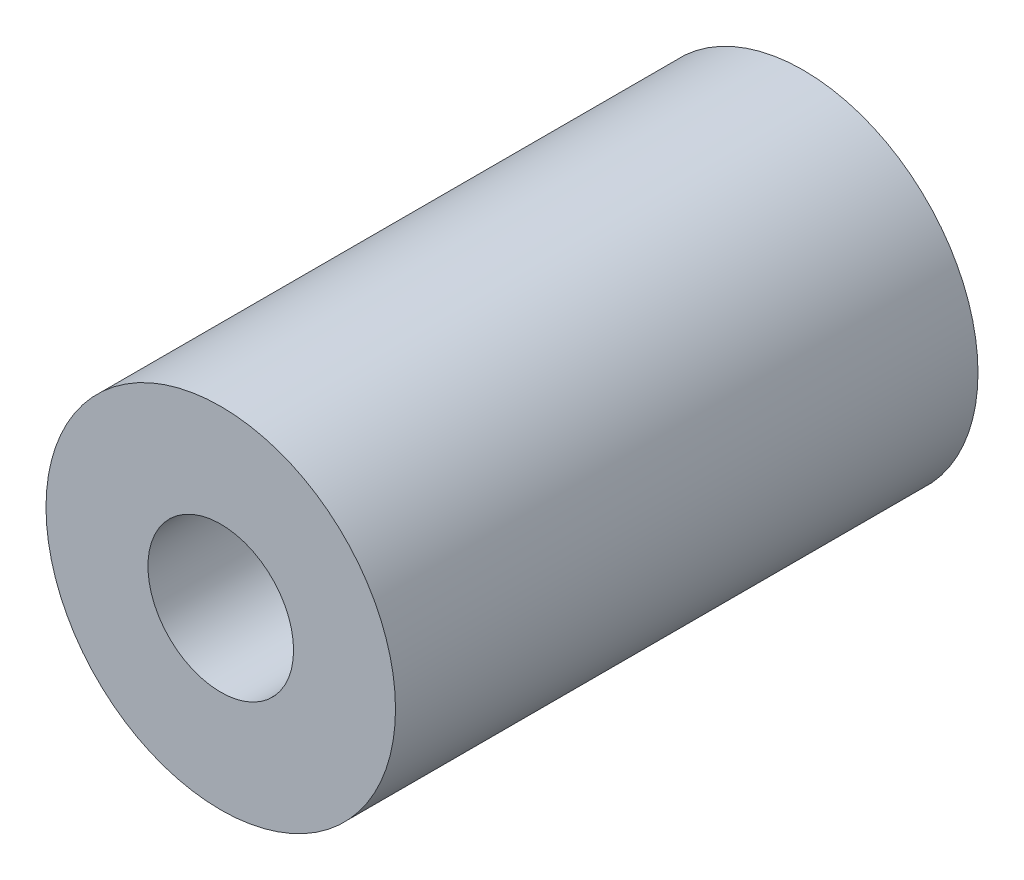
ISO-10303-21;
HEADER;
FILE_DESCRIPTION(('STEP AP214'),'2;1');
FILE_NAME('part.step','',(''),(''),'','','');
FILE_SCHEMA(('AUTOMOTIVE_DESIGN { 1 0 10303 214 1 1 1 1 }'));
ENDSEC;
DATA;
#1=APPLICATION_CONTEXT('core data for automotive mechanical design processes');
#2=APPLICATION_PROTOCOL_DEFINITION('international standard','automotive_design',2000,#1);
#3=PRODUCT_CONTEXT('',#1,'mechanical');
#4=PRODUCT('Part','Part','',(#3));
#5=PRODUCT_RELATED_PRODUCT_CATEGORY('part','',(#4));
#6=PRODUCT_DEFINITION_FORMATION('','',#4);
#7=PRODUCT_DEFINITION_CONTEXT('part definition',#1,'design');
#8=PRODUCT_DEFINITION('design','',#6,#7);
#9=PRODUCT_DEFINITION_SHAPE('','',#8);
#10=(LENGTH_UNIT() NAMED_UNIT(*) SI_UNIT(.MILLI.,.METRE.));
#11=(NAMED_UNIT(*) PLANE_ANGLE_UNIT() SI_UNIT($,.RADIAN.));
#12=(NAMED_UNIT(*) SI_UNIT($,.STERADIAN.) SOLID_ANGLE_UNIT());
#13=UNCERTAINTY_MEASURE_WITH_UNIT(LENGTH_MEASURE(1.E-05),#10,'distance_accuracy_value','');
#14=(GEOMETRIC_REPRESENTATION_CONTEXT(3) GLOBAL_UNCERTAINTY_ASSIGNED_CONTEXT((#13)) GLOBAL_UNIT_ASSIGNED_CONTEXT((#10,
#11,#12)) REPRESENTATION_CONTEXT('',''));
#15=CARTESIAN_POINT('',(0.,0.,0.));
#16=DIRECTION('',(0.,0.,1.));
#17=DIRECTION('',(1.,0.,0.));
#18=AXIS2_PLACEMENT_3D('',#15,#16,#17);
#19=CARTESIAN_POINT('',(0.,0.,10.));
#20=DIRECTION('',(0.,0.,-1.));
#21=DIRECTION('',(-1.,0.,0.));
#22=AXIS2_PLACEMENT_3D('',#19,#20,#21);
#23=CYLINDRICAL_SURFACE('',#22,3.);
#24=CARTESIAN_POINT('',(0.,0.,10.));
#25=DIRECTION('',(0.,0.,1.));
#26=DIRECTION('',(1.,0.,0.));
#27=AXIS2_PLACEMENT_3D('',#24,#25,#26);
#28=CIRCLE('',#27,3.);
#29=CARTESIAN_POINT('',(3.,0.,10.));
#30=VERTEX_POINT('',#29);
#31=EDGE_CURVE('E10',#30,#30,#28,.T.);
#32=ORIENTED_EDGE('',*,*,#31,.F.);
#33=EDGE_LOOP('',(#32));
#34=FACE_BOUND('',#33,.T.);
#35=CARTESIAN_POINT('',(0.,0.,0.));
#36=DIRECTION('',(0.,0.,1.));
#37=DIRECTION('',(1.,0.,0.));
#38=AXIS2_PLACEMENT_3D('',#35,#36,#37);
#39=CIRCLE('',#38,3.);
#40=CARTESIAN_POINT('',(3.,0.,0.));
#41=VERTEX_POINT('',#40);
#42=EDGE_CURVE('E40',#41,#41,#39,.T.);
#43=ORIENTED_EDGE('',*,*,#42,.T.);
#44=EDGE_LOOP('',(#43));
#45=FACE_BOUND('',#44,.T.);
#46=ADVANCED_FACE('F37',(#34,#45),#23,.T.);
#47=CARTESIAN_POINT('',(0.,0.,10.));
#48=DIRECTION('',(0.,0.,1.));
#49=DIRECTION('',(1.,0.,0.));
#50=AXIS2_PLACEMENT_3D('',#47,#48,#49);
#51=PLANE('',#50);
#52=CARTESIAN_POINT('',(0.,0.,10.));
#53=DIRECTION('',(0.,0.,1.));
#54=DIRECTION('',(1.,0.,0.));
#55=AXIS2_PLACEMENT_3D('',#52,#53,#54);
#56=CIRCLE('',#55,1.24999999999999);
#57=CARTESIAN_POINT('',(1.24999999999999,0.,10.));
#58=VERTEX_POINT('',#57);
#59=EDGE_CURVE('E51',#58,#58,#56,.T.);
#60=ORIENTED_EDGE('',*,*,#59,.F.);
#61=EDGE_LOOP('',(#60));
#62=FACE_BOUND('',#61,.T.);
#63=ORIENTED_EDGE('',*,*,#31,.T.);
#64=EDGE_LOOP('',(#63));
#65=FACE_BOUND('',#64,.T.);
#66=ADVANCED_FACE('F57',(#62,#65),#51,.T.);
#67=CARTESIAN_POINT('',(0.,0.,0.));
#68=DIRECTION('',(0.,0.,1.));
#69=DIRECTION('',(1.,0.,0.));
#70=AXIS2_PLACEMENT_3D('',#67,#68,#69);
#71=PLANE('',#70);
#72=CARTESIAN_POINT('',(0.,0.,0.));
#73=DIRECTION('',(0.,0.,1.));
#74=DIRECTION('',(1.,0.,0.));
#75=AXIS2_PLACEMENT_3D('',#72,#73,#74);
#76=CIRCLE('',#75,1.25);
#77=CARTESIAN_POINT('',(1.25,0.,0.));
#78=VERTEX_POINT('',#77);
#79=EDGE_CURVE('E47',#78,#78,#76,.T.);
#80=ORIENTED_EDGE('',*,*,#79,.T.);
#81=EDGE_LOOP('',(#80));
#82=FACE_BOUND('',#81,.T.);
#83=ORIENTED_EDGE('',*,*,#42,.F.);
#84=EDGE_LOOP('',(#83));
#85=FACE_BOUND('',#84,.T.);
#86=ADVANCED_FACE('F59',(#82,#85),#71,.F.);
#87=CARTESIAN_POINT('',(0.,0.,10.));
#88=DIRECTION('',(0.,0.,1.));
#89=DIRECTION('',(1.,0.,0.));
#90=AXIS2_PLACEMENT_3D('',#87,#88,#89);
#91=CYLINDRICAL_SURFACE('',#90,1.24999999999999);
#92=ORIENTED_EDGE('',*,*,#79,.F.);
#93=EDGE_LOOP('',(#92));
#94=FACE_BOUND('',#93,.T.);
#95=ORIENTED_EDGE('',*,*,#59,.T.);
#96=EDGE_LOOP('',(#95));
#97=FACE_BOUND('',#96,.T.);
#98=ADVANCED_FACE('F55',(#94,#97),#91,.F.);
#99=CLOSED_SHELL('',(#46,#66,#86,#98));
#100=MANIFOLD_SOLID_BREP('B2',#99);
#101=ADVANCED_BREP_SHAPE_REPRESENTATION('',(#18,#100),#14);
#102=SHAPE_DEFINITION_REPRESENTATION(#9,#101);
ENDSEC;
END-ISO-10303-21;
